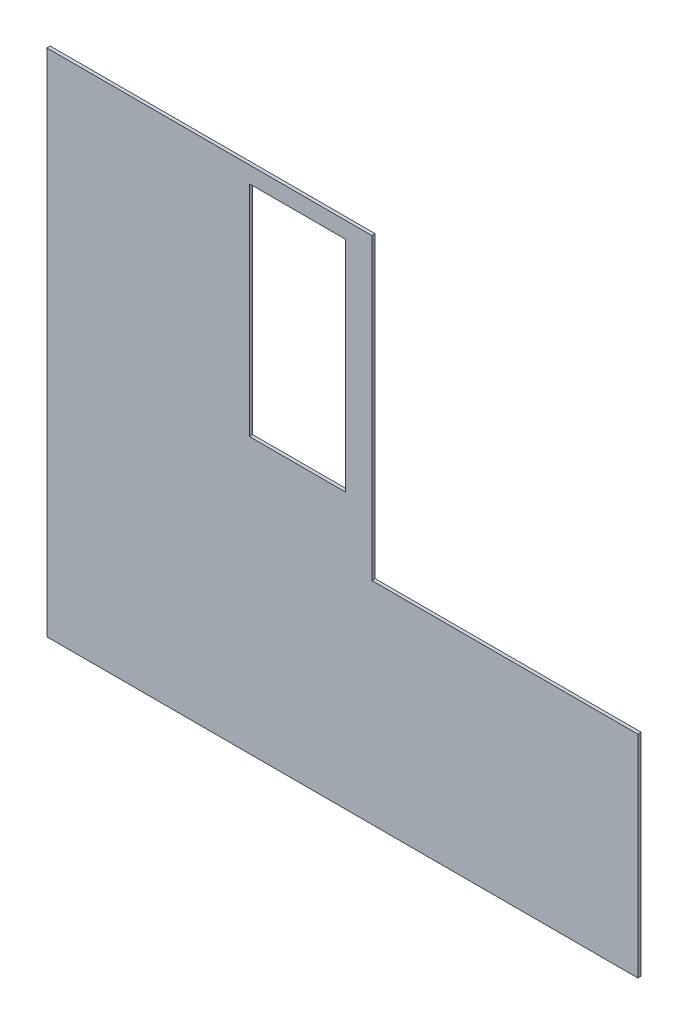
ISO-10303-21;
HEADER;
FILE_DESCRIPTION(('STEP AP214'),'2;1');
FILE_NAME('part.step','',(''),(''),'','','');
FILE_SCHEMA(('AUTOMOTIVE_DESIGN { 1 0 10303 214 1 1 1 1 }'));
ENDSEC;
DATA;
#1=APPLICATION_CONTEXT('core data for automotive mechanical design processes');
#2=APPLICATION_PROTOCOL_DEFINITION('international standard','automotive_design',2000,#1);
#3=PRODUCT_CONTEXT('',#1,'mechanical');
#4=PRODUCT('Part','Part','',(#3));
#5=PRODUCT_RELATED_PRODUCT_CATEGORY('part','',(#4));
#6=PRODUCT_DEFINITION_FORMATION('','',#4);
#7=PRODUCT_DEFINITION_CONTEXT('part definition',#1,'design');
#8=PRODUCT_DEFINITION('design','',#6,#7);
#9=PRODUCT_DEFINITION_SHAPE('','',#8);
#10=(LENGTH_UNIT() NAMED_UNIT(*) SI_UNIT(.MILLI.,.METRE.));
#11=(NAMED_UNIT(*) PLANE_ANGLE_UNIT() SI_UNIT($,.RADIAN.));
#12=(NAMED_UNIT(*) SI_UNIT($,.STERADIAN.) SOLID_ANGLE_UNIT());
#13=UNCERTAINTY_MEASURE_WITH_UNIT(LENGTH_MEASURE(1.E-05),#10,'distance_accuracy_value','');
#14=(GEOMETRIC_REPRESENTATION_CONTEXT(3) GLOBAL_UNCERTAINTY_ASSIGNED_CONTEXT((#13)) GLOBAL_UNIT_ASSIGNED_CONTEXT((#10,
#11,#12)) REPRESENTATION_CONTEXT('',''));
#15=CARTESIAN_POINT('',(0.,0.,0.));
#16=DIRECTION('',(0.,0.,1.));
#17=DIRECTION('',(1.,0.,0.));
#18=AXIS2_PLACEMENT_3D('',#15,#16,#17);
#19=CARTESIAN_POINT('',(0.,0.,3.));
#20=DIRECTION('',(0.,0.,-1.));
#21=DIRECTION('',(-1.,0.,0.));
#22=AXIS2_PLACEMENT_3D('',#19,#20,#21);
#23=PLANE('',#22);
#24=DIRECTION('',(0.,-1.,0.));
#25=VECTOR('',#24,1.);
#26=CARTESIAN_POINT('',(49.2230573206559,98.356221707281,3.));
#27=LINE('',#26,#25);
#28=CARTESIAN_POINT('',(49.2230573206559,98.356221707281,3.));
#29=VERTEX_POINT('',#28);
#30=CARTESIAN_POINT('',(49.223057320656,-367.643778292719,3.));
#31=VERTEX_POINT('',#30);
#32=EDGE_CURVE('E146',#29,#31,#27,.T.);
#33=ORIENTED_EDGE('',*,*,#32,.T.);
#34=DIRECTION('',(1.,0.,0.));
#35=VECTOR('',#34,1.);
#36=CARTESIAN_POINT('',(589.223057320656,-367.643778292719,3.));
#37=LINE('',#36,#35);
#38=CARTESIAN_POINT('',(589.223057320656,-367.643778292719,3.));
#39=VERTEX_POINT('',#38);
#40=EDGE_CURVE('E149',#31,#39,#37,.T.);
#41=ORIENTED_EDGE('',*,*,#40,.T.);
#42=DIRECTION('',(0.,1.,0.));
#43=VECTOR('',#42,1.);
#44=CARTESIAN_POINT('',(589.223057320656,-367.643778292719,3.));
#45=LINE('',#44,#43);
#46=CARTESIAN_POINT('',(589.223057320656,-174.643778292719,3.));
#47=VERTEX_POINT('',#46);
#48=EDGE_CURVE('E152',#39,#47,#45,.T.);
#49=ORIENTED_EDGE('',*,*,#48,.T.);
#50=DIRECTION('',(-1.,0.,0.));
#51=VECTOR('',#50,1.);
#52=CARTESIAN_POINT('',(346.223057320656,-174.643778292719,3.));
#53=LINE('',#52,#51);
#54=CARTESIAN_POINT('',(346.223057320656,-174.643778292719,3.));
#55=VERTEX_POINT('',#54);
#56=EDGE_CURVE('E154',#47,#55,#53,.T.);
#57=ORIENTED_EDGE('',*,*,#56,.T.);
#58=DIRECTION('',(0.,1.,0.));
#59=VECTOR('',#58,1.);
#60=CARTESIAN_POINT('',(346.223057320656,98.356221707281,3.));
#61=LINE('',#60,#59);
#62=CARTESIAN_POINT('',(346.223057320656,98.356221707281,3.));
#63=VERTEX_POINT('',#62);
#64=EDGE_CURVE('E156',#55,#63,#61,.T.);
#65=ORIENTED_EDGE('',*,*,#64,.T.);
#66=DIRECTION('',(-1.,0.,0.));
#67=VECTOR('',#66,1.);
#68=CARTESIAN_POINT('',(49.2230573206559,98.356221707281,3.));
#69=LINE('',#68,#67);
#70=EDGE_CURVE('E158',#63,#29,#69,.T.);
#71=ORIENTED_EDGE('',*,*,#70,.T.);
#72=EDGE_LOOP('',(#33,#41,#49,#57,#65,#71));
#73=FACE_BOUND('',#72,.T.);
#74=DIRECTION('',(0.,1.,0.));
#75=VECTOR('',#74,1.);
#76=CARTESIAN_POINT('',(322.223057320656,-116.643778292719,3.));
#77=LINE('',#76,#75);
#78=CARTESIAN_POINT('',(322.223057320656,-116.643778292719,3.));
#79=VERTEX_POINT('',#78);
#80=CARTESIAN_POINT('',(322.223057320656,83.356221707281,3.));
#81=VERTEX_POINT('',#80);
#82=EDGE_CURVE('E110',#79,#81,#77,.T.);
#83=ORIENTED_EDGE('',*,*,#82,.F.);
#84=DIRECTION('',(1.,0.,0.));
#85=VECTOR('',#84,1.);
#86=CARTESIAN_POINT('',(322.223057320656,-116.643778292719,3.));
#87=LINE('',#86,#85);
#88=CARTESIAN_POINT('',(234.223057320656,-116.643778292719,3.));
#89=VERTEX_POINT('',#88);
#90=EDGE_CURVE('E132',#89,#79,#87,.T.);
#91=ORIENTED_EDGE('',*,*,#90,.F.);
#92=DIRECTION('',(0.,-1.,0.));
#93=VECTOR('',#92,1.);
#94=CARTESIAN_POINT('',(234.223057320656,-116.643778292719,3.));
#95=LINE('',#94,#93);
#96=CARTESIAN_POINT('',(234.223057320656,83.356221707281,3.));
#97=VERTEX_POINT('',#96);
#98=EDGE_CURVE('E130',#97,#89,#95,.T.);
#99=ORIENTED_EDGE('',*,*,#98,.F.);
#100=DIRECTION('',(-1.,0.,0.));
#101=VECTOR('',#100,1.);
#102=CARTESIAN_POINT('',(322.223057320656,83.356221707281,3.));
#103=LINE('',#102,#101);
#104=EDGE_CURVE('E118',#81,#97,#103,.T.);
#105=ORIENTED_EDGE('',*,*,#104,.F.);
#106=EDGE_LOOP('',(#83,#91,#99,#105));
#107=FACE_BOUND('',#106,.T.);
#108=ADVANCED_FACE('F33',(#73,#107),#23,.F.);
#109=CARTESIAN_POINT('',(0.,0.,0.));
#110=DIRECTION('',(0.,0.,-1.));
#111=DIRECTION('',(-1.,0.,0.));
#112=AXIS2_PLACEMENT_3D('',#109,#110,#111);
#113=PLANE('',#112);
#114=DIRECTION('',(0.,-1.,0.));
#115=VECTOR('',#114,1.);
#116=CARTESIAN_POINT('',(49.2230573206559,98.356221707281,0.));
#117=LINE('',#116,#115);
#118=CARTESIAN_POINT('',(49.2230573206559,98.356221707281,0.));
#119=VERTEX_POINT('',#118);
#120=CARTESIAN_POINT('',(49.223057320656,-367.643778292719,0.));
#121=VERTEX_POINT('',#120);
#122=EDGE_CURVE('E126',#119,#121,#117,.T.);
#123=ORIENTED_EDGE('',*,*,#122,.F.);
#124=DIRECTION('',(-1.,0.,0.));
#125=VECTOR('',#124,1.);
#126=CARTESIAN_POINT('',(49.2230573206559,98.356221707281,0.));
#127=LINE('',#126,#125);
#128=CARTESIAN_POINT('',(346.223057320656,98.356221707281,0.));
#129=VERTEX_POINT('',#128);
#130=EDGE_CURVE('E150',#129,#119,#127,.T.);
#131=ORIENTED_EDGE('',*,*,#130,.F.);
#132=DIRECTION('',(0.,1.,0.));
#133=VECTOR('',#132,1.);
#134=CARTESIAN_POINT('',(346.223057320656,98.356221707281,0.));
#135=LINE('',#134,#133);
#136=CARTESIAN_POINT('',(346.223057320656,-174.643778292719,0.));
#137=VERTEX_POINT('',#136);
#138=EDGE_CURVE('E169',#137,#129,#135,.T.);
#139=ORIENTED_EDGE('',*,*,#138,.F.);
#140=DIRECTION('',(-1.,0.,0.));
#141=VECTOR('',#140,1.);
#142=CARTESIAN_POINT('',(346.223057320656,-174.643778292719,0.));
#143=LINE('',#142,#141);
#144=CARTESIAN_POINT('',(589.223057320656,-174.643778292719,0.));
#145=VERTEX_POINT('',#144);
#146=EDGE_CURVE('E167',#145,#137,#143,.T.);
#147=ORIENTED_EDGE('',*,*,#146,.F.);
#148=DIRECTION('',(0.,1.,0.));
#149=VECTOR('',#148,1.);
#150=CARTESIAN_POINT('',(589.223057320656,-367.643778292719,0.));
#151=LINE('',#150,#149);
#152=CARTESIAN_POINT('',(589.223057320656,-367.643778292719,0.));
#153=VERTEX_POINT('',#152);
#154=EDGE_CURVE('E165',#153,#145,#151,.T.);
#155=ORIENTED_EDGE('',*,*,#154,.F.);
#156=DIRECTION('',(1.,0.,0.));
#157=VECTOR('',#156,1.);
#158=CARTESIAN_POINT('',(589.223057320656,-367.643778292719,0.));
#159=LINE('',#158,#157);
#160=EDGE_CURVE('E163',#121,#153,#159,.T.);
#161=ORIENTED_EDGE('',*,*,#160,.F.);
#162=EDGE_LOOP('',(#123,#131,#139,#147,#155,#161));
#163=FACE_BOUND('',#162,.T.);
#164=DIRECTION('',(1.,0.,0.));
#165=VECTOR('',#164,1.);
#166=CARTESIAN_POINT('',(322.223057320656,-116.643778292719,0.));
#167=LINE('',#166,#165);
#168=CARTESIAN_POINT('',(234.223057320656,-116.643778292719,0.));
#169=VERTEX_POINT('',#168);
#170=CARTESIAN_POINT('',(322.223057320656,-116.643778292719,0.));
#171=VERTEX_POINT('',#170);
#172=EDGE_CURVE('E119',#169,#171,#167,.T.);
#173=ORIENTED_EDGE('',*,*,#172,.T.);
#174=DIRECTION('',(0.,1.,0.));
#175=VECTOR('',#174,1.);
#176=CARTESIAN_POINT('',(322.223057320656,-116.643778292719,0.));
#177=LINE('',#176,#175);
#178=CARTESIAN_POINT('',(322.223057320656,83.356221707281,0.));
#179=VERTEX_POINT('',#178);
#180=EDGE_CURVE('E56',#171,#179,#177,.T.);
#181=ORIENTED_EDGE('',*,*,#180,.T.);
#182=DIRECTION('',(-1.,0.,0.));
#183=VECTOR('',#182,1.);
#184=CARTESIAN_POINT('',(322.223057320656,83.356221707281,0.));
#185=LINE('',#184,#183);
#186=CARTESIAN_POINT('',(234.223057320656,83.356221707281,0.));
#187=VERTEX_POINT('',#186);
#188=EDGE_CURVE('E125',#179,#187,#185,.T.);
#189=ORIENTED_EDGE('',*,*,#188,.T.);
#190=DIRECTION('',(0.,-1.,0.));
#191=VECTOR('',#190,1.);
#192=CARTESIAN_POINT('',(234.223057320656,-116.643778292719,0.));
#193=LINE('',#192,#191);
#194=EDGE_CURVE('E138',#187,#169,#193,.T.);
#195=ORIENTED_EDGE('',*,*,#194,.T.);
#196=EDGE_LOOP('',(#173,#181,#189,#195));
#197=FACE_BOUND('',#196,.T.);
#198=ADVANCED_FACE('F193',(#163,#197),#113,.T.);
#199=CARTESIAN_POINT('',(49.2230573206559,98.356221707281,3.));
#200=DIRECTION('',(1.,0.,0.));
#201=DIRECTION('',(0.,1.,0.));
#202=AXIS2_PLACEMENT_3D('',#199,#200,#201);
#203=PLANE('',#202);
#204=ORIENTED_EDGE('',*,*,#122,.T.);
#205=DIRECTION('',(0.,0.,-1.));
#206=VECTOR('',#205,1.);
#207=CARTESIAN_POINT('',(49.223057320656,-367.643778292719,3.));
#208=LINE('',#207,#206);
#209=EDGE_CURVE('E11',#31,#121,#208,.T.);
#210=ORIENTED_EDGE('',*,*,#209,.F.);
#211=ORIENTED_EDGE('',*,*,#32,.F.);
#212=DIRECTION('',(0.,0.,-1.));
#213=VECTOR('',#212,1.);
#214=CARTESIAN_POINT('',(49.2230573206559,98.356221707281,3.));
#215=LINE('',#214,#213);
#216=EDGE_CURVE('E160',#29,#119,#215,.T.);
#217=ORIENTED_EDGE('',*,*,#216,.T.);
#218=EDGE_LOOP('',(#204,#210,#211,#217));
#219=FACE_BOUND('',#218,.T.);
#220=ADVANCED_FACE('F35',(#219),#203,.F.);
#221=CARTESIAN_POINT('',(589.223057320656,-367.643778292719,3.));
#222=DIRECTION('',(0.,1.,0.));
#223=DIRECTION('',(-1.,0.,0.));
#224=AXIS2_PLACEMENT_3D('',#221,#222,#223);
#225=PLANE('',#224);
#226=ORIENTED_EDGE('',*,*,#160,.T.);
#227=DIRECTION('',(0.,0.,-1.));
#228=VECTOR('',#227,1.);
#229=CARTESIAN_POINT('',(589.223057320656,-367.643778292719,3.));
#230=LINE('',#229,#228);
#231=EDGE_CURVE('E41',#39,#153,#230,.T.);
#232=ORIENTED_EDGE('',*,*,#231,.F.);
#233=ORIENTED_EDGE('',*,*,#40,.F.);
#234=ORIENTED_EDGE('',*,*,#209,.T.);
#235=EDGE_LOOP('',(#226,#232,#233,#234));
#236=FACE_BOUND('',#235,.T.);
#237=ADVANCED_FACE('F210',(#236),#225,.F.);
#238=CARTESIAN_POINT('',(589.223057320656,-367.643778292719,3.));
#239=DIRECTION('',(-1.,0.,0.));
#240=DIRECTION('',(0.,-1.,0.));
#241=AXIS2_PLACEMENT_3D('',#238,#239,#240);
#242=PLANE('',#241);
#243=ORIENTED_EDGE('',*,*,#154,.T.);
#244=DIRECTION('',(0.,0.,-1.));
#245=VECTOR('',#244,1.);
#246=CARTESIAN_POINT('',(589.223057320656,-174.643778292719,3.));
#247=LINE('',#246,#245);
#248=EDGE_CURVE('E180',#47,#145,#247,.T.);
#249=ORIENTED_EDGE('',*,*,#248,.F.);
#250=ORIENTED_EDGE('',*,*,#48,.F.);
#251=ORIENTED_EDGE('',*,*,#231,.T.);
#252=EDGE_LOOP('',(#243,#249,#250,#251));
#253=FACE_BOUND('',#252,.T.);
#254=ADVANCED_FACE('F187',(#253),#242,.F.);
#255=CARTESIAN_POINT('',(346.223057320656,-174.643778292719,3.));
#256=DIRECTION('',(0.,-1.,0.));
#257=DIRECTION('',(0.,0.,-1.));
#258=AXIS2_PLACEMENT_3D('',#255,#256,#257);
#259=PLANE('',#258);
#260=ORIENTED_EDGE('',*,*,#146,.T.);
#261=DIRECTION('',(0.,0.,-1.));
#262=VECTOR('',#261,1.);
#263=CARTESIAN_POINT('',(346.223057320656,-174.643778292719,3.));
#264=LINE('',#263,#262);
#265=EDGE_CURVE('E177',#55,#137,#264,.T.);
#266=ORIENTED_EDGE('',*,*,#265,.F.);
#267=ORIENTED_EDGE('',*,*,#56,.F.);
#268=ORIENTED_EDGE('',*,*,#248,.T.);
#269=EDGE_LOOP('',(#260,#266,#267,#268));
#270=FACE_BOUND('',#269,.T.);
#271=ADVANCED_FACE('F199',(#270),#259,.F.);
#272=CARTESIAN_POINT('',(346.223057320656,98.356221707281,3.));
#273=DIRECTION('',(-1.,0.,0.));
#274=DIRECTION('',(0.,-1.,0.));
#275=AXIS2_PLACEMENT_3D('',#272,#273,#274);
#276=PLANE('',#275);
#277=ORIENTED_EDGE('',*,*,#138,.T.);
#278=DIRECTION('',(0.,0.,-1.));
#279=VECTOR('',#278,1.);
#280=CARTESIAN_POINT('',(346.223057320656,98.356221707281,3.));
#281=LINE('',#280,#279);
#282=EDGE_CURVE('E174',#63,#129,#281,.T.);
#283=ORIENTED_EDGE('',*,*,#282,.F.);
#284=ORIENTED_EDGE('',*,*,#64,.F.);
#285=ORIENTED_EDGE('',*,*,#265,.T.);
#286=EDGE_LOOP('',(#277,#283,#284,#285));
#287=FACE_BOUND('',#286,.T.);
#288=ADVANCED_FACE('F203',(#287),#276,.F.);
#289=CARTESIAN_POINT('',(49.2230573206559,98.356221707281,3.));
#290=DIRECTION('',(0.,-1.,0.));
#291=DIRECTION('',(0.,0.,-1.));
#292=AXIS2_PLACEMENT_3D('',#289,#290,#291);
#293=PLANE('',#292);
#294=ORIENTED_EDGE('',*,*,#130,.T.);
#295=ORIENTED_EDGE('',*,*,#216,.F.);
#296=ORIENTED_EDGE('',*,*,#70,.F.);
#297=ORIENTED_EDGE('',*,*,#282,.T.);
#298=EDGE_LOOP('',(#294,#295,#296,#297));
#299=FACE_BOUND('',#298,.T.);
#300=ADVANCED_FACE('F213',(#299),#293,.F.);
#301=CARTESIAN_POINT('',(322.223057320656,-116.643778292719,3.));
#302=DIRECTION('',(-1.,0.,0.));
#303=DIRECTION('',(0.,0.,1.));
#304=AXIS2_PLACEMENT_3D('',#301,#302,#303);
#305=PLANE('',#304);
#306=ORIENTED_EDGE('',*,*,#180,.F.);
#307=DIRECTION('',(0.,0.,-1.));
#308=VECTOR('',#307,1.);
#309=CARTESIAN_POINT('',(322.223057320656,-116.643778292719,3.));
#310=LINE('',#309,#308);
#311=EDGE_CURVE('E114',#79,#171,#310,.T.);
#312=ORIENTED_EDGE('',*,*,#311,.F.);
#313=ORIENTED_EDGE('',*,*,#82,.T.);
#314=DIRECTION('',(0.,0.,-1.));
#315=VECTOR('',#314,1.);
#316=CARTESIAN_POINT('',(322.223057320656,83.356221707281,3.));
#317=LINE('',#316,#315);
#318=EDGE_CURVE('E113',#81,#179,#317,.T.);
#319=ORIENTED_EDGE('',*,*,#318,.T.);
#320=EDGE_LOOP('',(#306,#312,#313,#319));
#321=FACE_BOUND('',#320,.T.);
#322=ADVANCED_FACE('F112',(#321),#305,.T.);
#323=CARTESIAN_POINT('',(322.223057320656,83.356221707281,3.));
#324=DIRECTION('',(0.,-1.,0.));
#325=DIRECTION('',(1.,0.,0.));
#326=AXIS2_PLACEMENT_3D('',#323,#324,#325);
#327=PLANE('',#326);
#328=ORIENTED_EDGE('',*,*,#188,.F.);
#329=ORIENTED_EDGE('',*,*,#318,.F.);
#330=ORIENTED_EDGE('',*,*,#104,.T.);
#331=DIRECTION('',(0.,0.,-1.));
#332=VECTOR('',#331,1.);
#333=CARTESIAN_POINT('',(234.223057320656,83.356221707281,3.));
#334=LINE('',#333,#332);
#335=EDGE_CURVE('E127',#97,#187,#334,.T.);
#336=ORIENTED_EDGE('',*,*,#335,.T.);
#337=EDGE_LOOP('',(#328,#329,#330,#336));
#338=FACE_BOUND('',#337,.T.);
#339=ADVANCED_FACE('F122',(#338),#327,.T.);
#340=CARTESIAN_POINT('',(234.223057320656,-116.643778292719,3.));
#341=DIRECTION('',(1.,0.,0.));
#342=DIRECTION('',(0.,0.,-1.));
#343=AXIS2_PLACEMENT_3D('',#340,#341,#342);
#344=PLANE('',#343);
#345=ORIENTED_EDGE('',*,*,#194,.F.);
#346=ORIENTED_EDGE('',*,*,#335,.F.);
#347=ORIENTED_EDGE('',*,*,#98,.T.);
#348=DIRECTION('',(0.,0.,-1.));
#349=VECTOR('',#348,1.);
#350=CARTESIAN_POINT('',(234.223057320656,-116.643778292719,3.));
#351=LINE('',#350,#349);
#352=EDGE_CURVE('E48',#89,#169,#351,.T.);
#353=ORIENTED_EDGE('',*,*,#352,.T.);
#354=EDGE_LOOP('',(#345,#346,#347,#353));
#355=FACE_BOUND('',#354,.T.);
#356=ADVANCED_FACE('F231',(#355),#344,.T.);
#357=CARTESIAN_POINT('',(322.223057320656,-116.643778292719,3.));
#358=DIRECTION('',(0.,1.,0.));
#359=DIRECTION('',(-1.,0.,0.));
#360=AXIS2_PLACEMENT_3D('',#357,#358,#359);
#361=PLANE('',#360);
#362=ORIENTED_EDGE('',*,*,#172,.F.);
#363=ORIENTED_EDGE('',*,*,#352,.F.);
#364=ORIENTED_EDGE('',*,*,#90,.T.);
#365=ORIENTED_EDGE('',*,*,#311,.T.);
#366=EDGE_LOOP('',(#362,#363,#364,#365));
#367=FACE_BOUND('',#366,.T.);
#368=ADVANCED_FACE('F234',(#367),#361,.T.);
#369=CLOSED_SHELL('',(#108,#198,#220,#237,#254,#271,#288,#300,#322,#339,#356,#368));
#370=MANIFOLD_SOLID_BREP('B2',#369);
#371=ADVANCED_BREP_SHAPE_REPRESENTATION('',(#18,#370),#14);
#372=SHAPE_DEFINITION_REPRESENTATION(#9,#371);
ENDSEC;
END-ISO-10303-21;
